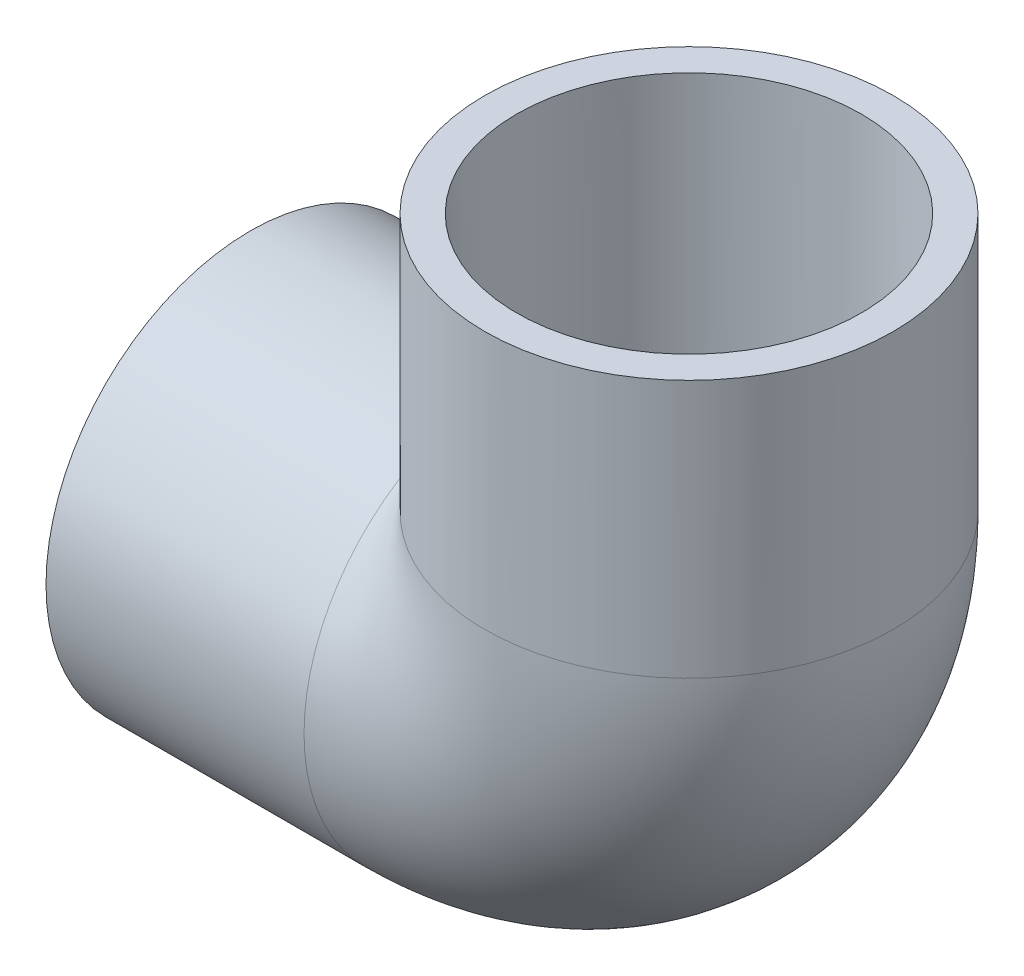
ISO-10303-21;
HEADER;
FILE_DESCRIPTION(('STEP AP214'),'2;1');
FILE_NAME('part.step','',(''),(''),'','','');
FILE_SCHEMA(('AUTOMOTIVE_DESIGN { 1 0 10303 214 1 1 1 1 }'));
ENDSEC;
DATA;
#1=APPLICATION_CONTEXT('core data for automotive mechanical design processes');
#2=APPLICATION_PROTOCOL_DEFINITION('international standard','automotive_design',2000,#1);
#3=PRODUCT_CONTEXT('',#1,'mechanical');
#4=PRODUCT('Part','Part','',(#3));
#5=PRODUCT_RELATED_PRODUCT_CATEGORY('part','',(#4));
#6=PRODUCT_DEFINITION_FORMATION('','',#4);
#7=PRODUCT_DEFINITION_CONTEXT('part definition',#1,'design');
#8=PRODUCT_DEFINITION('design','',#6,#7);
#9=PRODUCT_DEFINITION_SHAPE('','',#8);
#10=(LENGTH_UNIT() NAMED_UNIT(*) SI_UNIT(.MILLI.,.METRE.));
#11=(NAMED_UNIT(*) PLANE_ANGLE_UNIT() SI_UNIT($,.RADIAN.));
#12=(NAMED_UNIT(*) SI_UNIT($,.STERADIAN.) SOLID_ANGLE_UNIT());
#13=UNCERTAINTY_MEASURE_WITH_UNIT(LENGTH_MEASURE(1.E-05),#10,'distance_accuracy_value','');
#14=(GEOMETRIC_REPRESENTATION_CONTEXT(3) GLOBAL_UNCERTAINTY_ASSIGNED_CONTEXT((#13)) GLOBAL_UNIT_ASSIGNED_CONTEXT((#10,
#11,#12)) REPRESENTATION_CONTEXT('',''));
#15=CARTESIAN_POINT('',(0.,0.,0.));
#16=DIRECTION('',(0.,0.,1.));
#17=DIRECTION('',(1.,0.,0.));
#18=AXIS2_PLACEMENT_3D('',#15,#16,#17);
#19=CARTESIAN_POINT('',(-53.975,-25.146,0.));
#20=DIRECTION('',(-1.,0.,0.));
#21=DIRECTION('',(0.,0.,1.));
#22=AXIS2_PLACEMENT_3D('',#19,#20,#21);
#23=PLANE('',#22);
#24=CARTESIAN_POINT('',(-53.975,0.,0.));
#25=DIRECTION('',(-1.,0.,0.));
#26=DIRECTION('',(0.,0.,1.));
#27=AXIS2_PLACEMENT_3D('',#24,#25,#26);
#28=CIRCLE('',#27,25.146);
#29=CARTESIAN_POINT('',(-53.975,0.,25.146));
#30=VERTEX_POINT('',#29);
#31=EDGE_CURVE('E52',#30,#30,#28,.T.);
#32=ORIENTED_EDGE('',*,*,#31,.T.);
#33=EDGE_LOOP('',(#32));
#34=FACE_BOUND('',#33,.T.);
#35=CARTESIAN_POINT('',(-53.975,0.,0.));
#36=DIRECTION('',(-1.,0.,0.));
#37=DIRECTION('',(0.,0.,1.));
#38=AXIS2_PLACEMENT_3D('',#35,#36,#37);
#39=CIRCLE('',#38,21.209);
#40=CARTESIAN_POINT('',(-53.975,0.,21.209));
#41=VERTEX_POINT('',#40);
#42=EDGE_CURVE('E39',#41,#41,#39,.T.);
#43=ORIENTED_EDGE('',*,*,#42,.F.);
#44=EDGE_LOOP('',(#43));
#45=FACE_BOUND('',#44,.T.);
#46=ADVANCED_FACE('F32',(#34,#45),#23,.T.);
#47=CARTESIAN_POINT('',(-22.225,0.,0.));
#48=DIRECTION('',(-1.,0.,0.));
#49=DIRECTION('',(0.,0.,1.));
#50=AXIS2_PLACEMENT_3D('',#47,#48,#49);
#51=CONICAL_SURFACE('',#50,21.0185,0.00599992800155515);
#52=ORIENTED_EDGE('',*,*,#42,.T.);
#53=EDGE_LOOP('',(#52));
#54=FACE_BOUND('',#53,.T.);
#55=CARTESIAN_POINT('',(-22.225,0.,0.));
#56=DIRECTION('',(-1.,0.,0.));
#57=DIRECTION('',(0.,0.,1.));
#58=AXIS2_PLACEMENT_3D('',#55,#56,#57);
#59=CIRCLE('',#58,21.0185);
#60=CARTESIAN_POINT('',(-22.225,0.,21.0185));
#61=VERTEX_POINT('',#60);
#62=EDGE_CURVE('E63',#61,#61,#59,.T.);
#63=ORIENTED_EDGE('',*,*,#62,.F.);
#64=EDGE_LOOP('',(#63));
#65=FACE_BOUND('',#64,.T.);
#66=ADVANCED_FACE('F72',(#54,#65),#51,.F.);
#67=CARTESIAN_POINT('',(-53.975,0.,0.));
#68=DIRECTION('',(-1.,0.,0.));
#69=DIRECTION('',(0.,0.,1.));
#70=AXIS2_PLACEMENT_3D('',#67,#68,#69);
#71=CYLINDRICAL_SURFACE('',#70,25.146);
#72=CARTESIAN_POINT('',(0.,0.,0.));
#73=DIRECTION('',(-0.707106781186547,-0.707106781186547,0.));
#74=DIRECTION('',(-0.707106781186547,0.707106781186547,0.));
#75=AXIS2_PLACEMENT_3D('',#72,#73,#74);
#76=ELLIPSE('',#75,35.5618142394338,25.146);
#77=CARTESIAN_POINT('',(-22.225,22.225,-11.7631072000556));
#78=VERTEX_POINT('',#77);
#79=CARTESIAN_POINT('',(-22.225,22.225,11.7631072000556));
#80=VERTEX_POINT('',#79);
#81=EDGE_CURVE('E51',#78,#80,#76,.F.);
#82=ORIENTED_EDGE('',*,*,#81,.F.);
#83=CARTESIAN_POINT('',(-22.225,0.,0.));
#84=DIRECTION('',(-1.,0.,0.));
#85=DIRECTION('',(0.,0.,1.));
#86=AXIS2_PLACEMENT_3D('',#83,#84,#85);
#87=CIRCLE('',#86,25.146);
#88=EDGE_CURVE('E58',#78,#80,#87,.T.);
#89=ORIENTED_EDGE('',*,*,#88,.T.);
#90=EDGE_LOOP('',(#82,#89));
#91=FACE_BOUND('',#90,.T.);
#92=ORIENTED_EDGE('',*,*,#31,.F.);
#93=EDGE_LOOP('',(#92));
#94=FACE_BOUND('',#93,.T.);
#95=ADVANCED_FACE('F56',(#91,#94),#71,.T.);
#96=CARTESIAN_POINT('',(-22.225,22.225,0.));
#97=DIRECTION('',(0.,0.,-1.));
#98=DIRECTION('',(-1.,0.,0.));
#99=AXIS2_PLACEMENT_3D('',#96,#97,#98);
#100=TOROIDAL_SURFACE('',#99,22.225,17.526);
#101=CARTESIAN_POINT('',(0.,22.225,0.));
#102=DIRECTION('',(0.,1.,0.));
#103=DIRECTION('',(0.,0.,-1.));
#104=AXIS2_PLACEMENT_3D('',#101,#102,#103);
#105=CIRCLE('',#104,17.526);
#106=CARTESIAN_POINT('',(17.526,22.225,0.));
#107=VERTEX_POINT('',#106);
#108=EDGE_CURVE('E53',#107,#107,#105,.T.);
#109=CARTESIAN_POINT('',(-22.225,0.,0.));
#110=DIRECTION('',(1.,0.,0.));
#111=DIRECTION('',(0.,0.,-1.));
#112=AXIS2_PLACEMENT_3D('',#109,#110,#111);
#113=CIRCLE('',#112,17.526);
#114=CARTESIAN_POINT('',(-22.225,-17.526,0.));
#115=VERTEX_POINT('',#114);
#116=EDGE_CURVE('E59',#115,#115,#113,.T.);
#117=CARTESIAN_POINT('',(-22.225,22.225,0.));
#118=DIRECTION('',(0.,0.,-1.));
#119=DIRECTION('',(-1.,0.,0.));
#120=AXIS2_PLACEMENT_3D('',#117,#118,#119);
#121=CIRCLE('',#120,39.751);
#122=EDGE_CURVE('',#107,#115,#121,.T.);
#123=ORIENTED_EDGE('',*,*,#108,.T.);
#124=ORIENTED_EDGE('',*,*,#116,.F.);
#125=ORIENTED_EDGE('',*,*,#122,.T.);
#126=ORIENTED_EDGE('',*,*,#122,.F.);
#127=EDGE_LOOP('',(#123,#125,#124,#126));
#128=FACE_BOUND('',#127,.T.);
#129=ADVANCED_FACE('F82',(#128),#100,.F.);
#130=CARTESIAN_POINT('',(-44.45,22.225,0.));
#131=DIRECTION('',(0.,-1.,0.));
#132=DIRECTION('',(-1.,0.,0.));
#133=AXIS2_PLACEMENT_3D('',#130,#131,#132);
#134=CIRCLE('',#133,25.146);
#135=TRIMMED_CURVE('',#134,(PARAMETER_VALUE(-2.6548012951665)),
(PARAMETER_VALUE(2.6548012951665)),.T.,.PARAMETER.);
#136=CARTESIAN_POINT('',(-22.225,22.225,0.));
#137=DIRECTION('',(0.,0.,-1.));
#138=AXIS1_PLACEMENT('',#136,#137);
#139=SURFACE_OF_REVOLUTION('',#135,#138);
#140=CARTESIAN_POINT('',(0.,22.225,0.));
#141=DIRECTION('',(0.,1.,0.));
#142=DIRECTION('',(0.,0.,-1.));
#143=AXIS2_PLACEMENT_3D('',#140,#141,#142);
#144=CIRCLE('',#143,25.146);
#145=EDGE_CURVE('E45',#80,#78,#144,.T.);
#146=ORIENTED_EDGE('',*,*,#145,.F.);
#147=ORIENTED_EDGE('',*,*,#88,.F.);
#148=EDGE_LOOP('',(#146,#147));
#149=FACE_BOUND('',#148,.T.);
#150=ADVANCED_FACE('F62',(#149),#139,.T.);
#151=CARTESIAN_POINT('',(0.,22.225,0.));
#152=DIRECTION('',(0.,1.,0.));
#153=DIRECTION('',(0.,0.,-1.));
#154=AXIS2_PLACEMENT_3D('',#151,#152,#153);
#155=PLANE('',#154);
#156=CARTESIAN_POINT('',(0.,22.225,0.));
#157=DIRECTION('',(0.,1.,0.));
#158=DIRECTION('',(-1.,0.,0.));
#159=AXIS2_PLACEMENT_3D('',#156,#157,#158);
#160=CIRCLE('',#159,21.0185);
#161=CARTESIAN_POINT('',(-21.0185,22.225,0.));
#162=VERTEX_POINT('',#161);
#163=EDGE_CURVE('E11',#162,#162,#160,.F.);
#164=ORIENTED_EDGE('',*,*,#163,.F.);
#165=EDGE_LOOP('',(#164));
#166=FACE_BOUND('',#165,.T.);
#167=ORIENTED_EDGE('',*,*,#108,.F.);
#168=EDGE_LOOP('',(#167));
#169=FACE_BOUND('',#168,.T.);
#170=ADVANCED_FACE('F89',(#166,#169),#155,.T.);
#171=CARTESIAN_POINT('',(-22.225,0.,0.));
#172=DIRECTION('',(1.,0.,0.));
#173=DIRECTION('',(0.,0.,-1.));
#174=AXIS2_PLACEMENT_3D('',#171,#172,#173);
#175=PLANE('',#174);
#176=ORIENTED_EDGE('',*,*,#62,.T.);
#177=EDGE_LOOP('',(#176));
#178=FACE_BOUND('',#177,.T.);
#179=ORIENTED_EDGE('',*,*,#116,.T.);
#180=EDGE_LOOP('',(#179));
#181=FACE_BOUND('',#180,.T.);
#182=ADVANCED_FACE('F92',(#178,#181),#175,.F.);
#183=CARTESIAN_POINT('',(25.146,53.975,0.));
#184=DIRECTION('',(0.,1.,0.));
#185=DIRECTION('',(0.,0.,1.));
#186=AXIS2_PLACEMENT_3D('',#183,#184,#185);
#187=PLANE('',#186);
#188=CARTESIAN_POINT('',(0.,53.975,0.));
#189=DIRECTION('',(0.,-1.,0.));
#190=DIRECTION('',(0.,0.,-1.));
#191=AXIS2_PLACEMENT_3D('',#188,#189,#190);
#192=CIRCLE('',#191,21.209);
#193=CARTESIAN_POINT('',(0.,53.975,-21.209));
#194=VERTEX_POINT('',#193);
#195=EDGE_CURVE('E116',#194,#194,#192,.T.);
#196=ORIENTED_EDGE('',*,*,#195,.T.);
#197=EDGE_LOOP('',(#196));
#198=FACE_BOUND('',#197,.T.);
#199=CARTESIAN_POINT('',(0.,53.975,0.));
#200=DIRECTION('',(0.,-1.,0.));
#201=DIRECTION('',(0.,0.,-1.));
#202=AXIS2_PLACEMENT_3D('',#199,#200,#201);
#203=CIRCLE('',#202,25.146);
#204=CARTESIAN_POINT('',(0.,53.975,-25.146));
#205=VERTEX_POINT('',#204);
#206=EDGE_CURVE('E60',#205,#205,#203,.T.);
#207=ORIENTED_EDGE('',*,*,#206,.F.);
#208=EDGE_LOOP('',(#207));
#209=FACE_BOUND('',#208,.T.);
#210=ADVANCED_FACE('F99',(#198,#209),#187,.T.);
#211=CARTESIAN_POINT('',(0.,0.,0.));
#212=DIRECTION('',(0.,-1.,0.));
#213=DIRECTION('',(0.,0.,-1.));
#214=AXIS2_PLACEMENT_3D('',#211,#212,#213);
#215=CYLINDRICAL_SURFACE('',#214,25.146);
#216=ORIENTED_EDGE('',*,*,#206,.T.);
#217=EDGE_LOOP('',(#216));
#218=FACE_BOUND('',#217,.T.);
#219=ORIENTED_EDGE('',*,*,#145,.T.);
#220=ORIENTED_EDGE('',*,*,#81,.T.);
#221=EDGE_LOOP('',(#219,#220));
#222=FACE_BOUND('',#221,.T.);
#223=ADVANCED_FACE('F50',(#218,#222),#215,.T.);
#224=CARTESIAN_POINT('',(0.,53.975,0.));
#225=DIRECTION('',(0.,1.,0.));
#226=DIRECTION('',(0.,0.,1.));
#227=AXIS2_PLACEMENT_3D('',#224,#225,#226);
#228=CONICAL_SURFACE('',#227,21.209,0.00599992800155515);
#229=ORIENTED_EDGE('',*,*,#163,.T.);
#230=EDGE_LOOP('',(#229));
#231=FACE_BOUND('',#230,.T.);
#232=ORIENTED_EDGE('',*,*,#195,.F.);
#233=EDGE_LOOP('',(#232));
#234=FACE_BOUND('',#233,.T.);
#235=ADVANCED_FACE('F106',(#231,#234),#228,.F.);
#236=CLOSED_SHELL('',(#46,#66,#95,#129,#150,#170,#182,#210,#223,#235));
#237=MANIFOLD_SOLID_BREP('B2',#236);
#238=ADVANCED_BREP_SHAPE_REPRESENTATION('',(#18,#237),#14);
#239=SHAPE_DEFINITION_REPRESENTATION(#9,#238);
ENDSEC;
END-ISO-10303-21;
